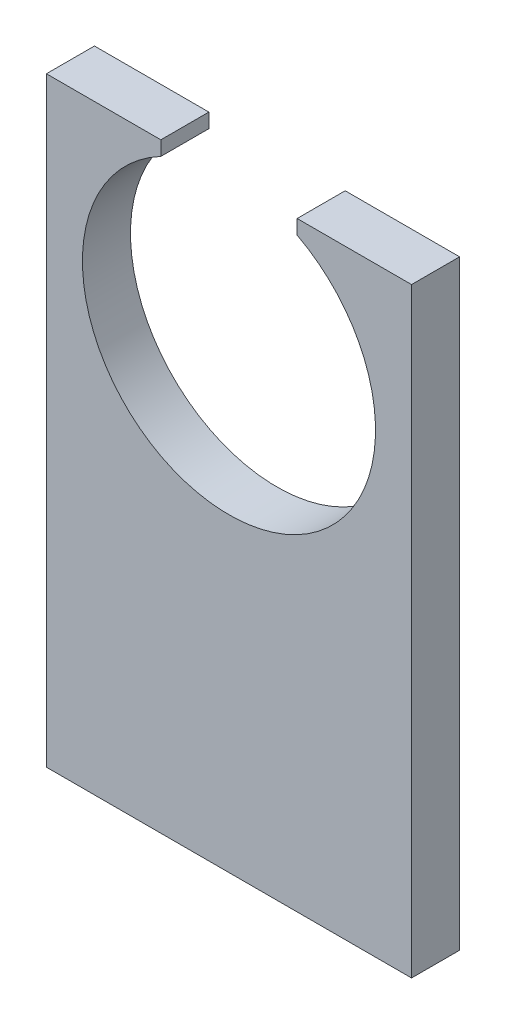
ISO-10303-21;
HEADER;
FILE_DESCRIPTION(('STEP AP214'),'2;1');
FILE_NAME('part.step','',(''),(''),'','','');
FILE_SCHEMA(('AUTOMOTIVE_DESIGN { 1 0 10303 214 1 1 1 1 }'));
ENDSEC;
DATA;
#1=APPLICATION_CONTEXT('core data for automotive mechanical design processes');
#2=APPLICATION_PROTOCOL_DEFINITION('international standard','automotive_design',2000,#1);
#3=PRODUCT_CONTEXT('',#1,'mechanical');
#4=PRODUCT('Part','Part','',(#3));
#5=PRODUCT_RELATED_PRODUCT_CATEGORY('part','',(#4));
#6=PRODUCT_DEFINITION_FORMATION('','',#4);
#7=PRODUCT_DEFINITION_CONTEXT('part definition',#1,'design');
#8=PRODUCT_DEFINITION('design','',#6,#7);
#9=PRODUCT_DEFINITION_SHAPE('','',#8);
#10=(LENGTH_UNIT() NAMED_UNIT(*) SI_UNIT(.MILLI.,.METRE.));
#11=(NAMED_UNIT(*) PLANE_ANGLE_UNIT() SI_UNIT($,.RADIAN.));
#12=(NAMED_UNIT(*) SI_UNIT($,.STERADIAN.) SOLID_ANGLE_UNIT());
#13=UNCERTAINTY_MEASURE_WITH_UNIT(LENGTH_MEASURE(1.E-05),#10,'distance_accuracy_value','');
#14=(GEOMETRIC_REPRESENTATION_CONTEXT(3) GLOBAL_UNCERTAINTY_ASSIGNED_CONTEXT((#13)) GLOBAL_UNIT_ASSIGNED_CONTEXT((#10,
#11,#12)) REPRESENTATION_CONTEXT('',''));
#15=CARTESIAN_POINT('',(0.,0.,0.));
#16=DIRECTION('',(0.,0.,1.));
#17=DIRECTION('',(1.,0.,0.));
#18=AXIS2_PLACEMENT_3D('',#15,#16,#17);
#19=CARTESIAN_POINT('',(0.,0.,48.));
#20=DIRECTION('',(0.,0.,1.));
#21=DIRECTION('',(1.,0.,0.));
#22=AXIS2_PLACEMENT_3D('',#19,#20,#21);
#23=PLANE('',#22);
#24=DIRECTION('',(0.,-1.,0.));
#25=VECTOR('',#24,1.);
#26=CARTESIAN_POINT('',(-14.1862609591111,0.,48.));
#27=LINE('',#26,#25);
#28=CARTESIAN_POINT('',(-14.1862609591111,117.5,48.));
#29=VERTEX_POINT('',#28);
#30=CARTESIAN_POINT('',(-14.1862609591111,114.5,48.));
#31=VERTEX_POINT('',#30);
#32=EDGE_CURVE('E102',#29,#31,#27,.T.);
#33=ORIENTED_EDGE('',*,*,#32,.F.);
#34=DIRECTION('',(1.,0.,0.));
#35=VECTOR('',#34,1.);
#36=CARTESIAN_POINT('',(-38.,117.5,48.));
#37=LINE('',#36,#35);
#38=CARTESIAN_POINT('',(-38.,117.5,48.));
#39=VERTEX_POINT('',#38);
#40=EDGE_CURVE('E158',#39,#29,#37,.T.);
#41=ORIENTED_EDGE('',*,*,#40,.F.);
#42=DIRECTION('',(0.,-1.,0.));
#43=VECTOR('',#42,1.);
#44=CARTESIAN_POINT('',(-38.,-7.5,48.));
#45=LINE('',#44,#43);
#46=CARTESIAN_POINT('',(-38.,-7.5,48.));
#47=VERTEX_POINT('',#46);
#48=EDGE_CURVE('E132',#39,#47,#45,.T.);
#49=ORIENTED_EDGE('',*,*,#48,.T.);
#50=DIRECTION('',(1.,0.,0.));
#51=VECTOR('',#50,1.);
#52=CARTESIAN_POINT('',(38.,-7.5,48.));
#53=LINE('',#52,#51);
#54=CARTESIAN_POINT('',(38.,-7.5,48.));
#55=VERTEX_POINT('',#54);
#56=EDGE_CURVE('E134',#47,#55,#53,.T.);
#57=ORIENTED_EDGE('',*,*,#56,.T.);
#58=DIRECTION('',(0.,1.,0.));
#59=VECTOR('',#58,1.);
#60=CARTESIAN_POINT('',(38.,-7.5,48.));
#61=LINE('',#60,#59);
#62=CARTESIAN_POINT('',(38.,117.5,48.));
#63=VERTEX_POINT('',#62);
#64=EDGE_CURVE('E137',#55,#63,#61,.T.);
#65=ORIENTED_EDGE('',*,*,#64,.T.);
#66=CARTESIAN_POINT('',(14.1862609591111,117.5,48.));
#67=VERTEX_POINT('',#66);
#68=EDGE_CURVE('E107',#67,#63,#37,.T.);
#69=ORIENTED_EDGE('',*,*,#68,.F.);
#70=DIRECTION('',(0.,-1.,0.));
#71=VECTOR('',#70,1.);
#72=CARTESIAN_POINT('',(14.1862609591111,0.,48.));
#73=LINE('',#72,#71);
#74=CARTESIAN_POINT('',(14.1862609591111,114.5,48.));
#75=VERTEX_POINT('',#74);
#76=EDGE_CURVE('E51',#67,#75,#73,.T.);
#77=ORIENTED_EDGE('',*,*,#76,.T.);
#78=CARTESIAN_POINT('',(0.,87.5,48.));
#79=DIRECTION('',(0.,0.,1.));
#80=DIRECTION('',(1.,0.,0.));
#81=AXIS2_PLACEMENT_3D('',#78,#79,#80);
#82=CIRCLE('',#81,30.5);
#83=EDGE_CURVE('E122',#31,#75,#82,.T.);
#84=ORIENTED_EDGE('',*,*,#83,.F.);
#85=EDGE_LOOP('',(#33,#41,#49,#57,#65,#69,#77,#84));
#86=FACE_BOUND('',#85,.T.);
#87=ADVANCED_FACE('F36',(#86),#23,.T.);
#88=CARTESIAN_POINT('',(0.,0.,38.));
#89=DIRECTION('',(0.,0.,1.));
#90=DIRECTION('',(1.,0.,0.));
#91=AXIS2_PLACEMENT_3D('',#88,#89,#90);
#92=PLANE('',#91);
#93=DIRECTION('',(1.,0.,0.));
#94=VECTOR('',#93,1.);
#95=CARTESIAN_POINT('',(-38.,117.5,38.));
#96=LINE('',#95,#94);
#97=CARTESIAN_POINT('',(-38.,117.5,38.));
#98=VERTEX_POINT('',#97);
#99=CARTESIAN_POINT('',(-14.1862609591111,117.5,38.));
#100=VERTEX_POINT('',#99);
#101=EDGE_CURVE('E117',#98,#100,#96,.T.);
#102=ORIENTED_EDGE('',*,*,#101,.T.);
#103=DIRECTION('',(0.,-1.,0.));
#104=VECTOR('',#103,1.);
#105=CARTESIAN_POINT('',(-14.1862609591111,0.,38.));
#106=LINE('',#105,#104);
#107=CARTESIAN_POINT('',(-14.1862609591111,114.5,38.));
#108=VERTEX_POINT('',#107);
#109=EDGE_CURVE('E59',#100,#108,#106,.T.);
#110=ORIENTED_EDGE('',*,*,#109,.T.);
#111=CARTESIAN_POINT('',(0.,87.5,38.));
#112=DIRECTION('',(0.,0.,1.));
#113=DIRECTION('',(1.,0.,0.));
#114=AXIS2_PLACEMENT_3D('',#111,#112,#113);
#115=CIRCLE('',#114,30.5);
#116=CARTESIAN_POINT('',(14.1862609591111,114.5,38.));
#117=VERTEX_POINT('',#116);
#118=EDGE_CURVE('E115',#108,#117,#115,.T.);
#119=ORIENTED_EDGE('',*,*,#118,.T.);
#120=DIRECTION('',(0.,-1.,0.));
#121=VECTOR('',#120,1.);
#122=CARTESIAN_POINT('',(14.1862609591111,0.,38.));
#123=LINE('',#122,#121);
#124=CARTESIAN_POINT('',(14.1862609591111,117.5,38.));
#125=VERTEX_POINT('',#124);
#126=EDGE_CURVE('E156',#125,#117,#123,.T.);
#127=ORIENTED_EDGE('',*,*,#126,.F.);
#128=CARTESIAN_POINT('',(38.,117.5,38.));
#129=VERTEX_POINT('',#128);
#130=EDGE_CURVE('E154',#125,#129,#96,.T.);
#131=ORIENTED_EDGE('',*,*,#130,.T.);
#132=DIRECTION('',(0.,1.,0.));
#133=VECTOR('',#132,1.);
#134=CARTESIAN_POINT('',(38.,-7.5,38.));
#135=LINE('',#134,#133);
#136=CARTESIAN_POINT('',(38.,-7.5,38.));
#137=VERTEX_POINT('',#136);
#138=EDGE_CURVE('E135',#137,#129,#135,.T.);
#139=ORIENTED_EDGE('',*,*,#138,.F.);
#140=DIRECTION('',(1.,0.,0.));
#141=VECTOR('',#140,1.);
#142=CARTESIAN_POINT('',(38.,-7.5,38.));
#143=LINE('',#142,#141);
#144=CARTESIAN_POINT('',(-38.,-7.5,38.));
#145=VERTEX_POINT('',#144);
#146=EDGE_CURVE('E141',#145,#137,#143,.T.);
#147=ORIENTED_EDGE('',*,*,#146,.F.);
#148=DIRECTION('',(0.,-1.,0.));
#149=VECTOR('',#148,1.);
#150=CARTESIAN_POINT('',(-38.,-7.5,38.));
#151=LINE('',#150,#149);
#152=EDGE_CURVE('E125',#98,#145,#151,.T.);
#153=ORIENTED_EDGE('',*,*,#152,.F.);
#154=EDGE_LOOP('',(#102,#110,#119,#127,#131,#139,#147,#153));
#155=FACE_BOUND('',#154,.T.);
#156=ADVANCED_FACE('F113',(#155),#92,.F.);
#157=CARTESIAN_POINT('',(0.,87.5,48.));
#158=DIRECTION('',(0.,0.,-1.));
#159=DIRECTION('',(-1.,0.,0.));
#160=AXIS2_PLACEMENT_3D('',#157,#158,#159);
#161=CYLINDRICAL_SURFACE('',#160,30.5);
#162=DIRECTION('',(0.,0.,1.));
#163=VECTOR('',#162,1.);
#164=CARTESIAN_POINT('',(-14.1862609591111,114.5,38.));
#165=LINE('',#164,#163);
#166=EDGE_CURVE('E99',#108,#31,#165,.T.);
#167=ORIENTED_EDGE('',*,*,#166,.T.);
#168=ORIENTED_EDGE('',*,*,#83,.T.);
#169=DIRECTION('',(0.,0.,1.));
#170=VECTOR('',#169,1.);
#171=CARTESIAN_POINT('',(14.1862609591111,114.5,38.));
#172=LINE('',#171,#170);
#173=EDGE_CURVE('E121',#117,#75,#172,.T.);
#174=ORIENTED_EDGE('',*,*,#173,.F.);
#175=ORIENTED_EDGE('',*,*,#118,.F.);
#176=EDGE_LOOP('',(#167,#168,#174,#175));
#177=FACE_BOUND('',#176,.T.);
#178=ADVANCED_FACE('F120',(#177),#161,.F.);
#179=CARTESIAN_POINT('',(-38.,117.5,38.));
#180=DIRECTION('',(0.,-1.,0.));
#181=DIRECTION('',(0.,0.,-1.));
#182=AXIS2_PLACEMENT_3D('',#179,#180,#181);
#183=PLANE('',#182);
#184=DIRECTION('',(0.,0.,1.));
#185=VECTOR('',#184,1.);
#186=CARTESIAN_POINT('',(14.1862609591111,117.5,38.));
#187=LINE('',#186,#185);
#188=EDGE_CURVE('E173',#125,#67,#187,.T.);
#189=ORIENTED_EDGE('',*,*,#188,.T.);
#190=ORIENTED_EDGE('',*,*,#68,.T.);
#191=DIRECTION('',(0.,0.,1.));
#192=VECTOR('',#191,1.);
#193=CARTESIAN_POINT('',(38.,117.5,38.));
#194=LINE('',#193,#192);
#195=EDGE_CURVE('E123',#129,#63,#194,.T.);
#196=ORIENTED_EDGE('',*,*,#195,.F.);
#197=ORIENTED_EDGE('',*,*,#130,.F.);
#198=EDGE_LOOP('',(#189,#190,#196,#197));
#199=FACE_BOUND('',#198,.T.);
#200=ADVANCED_FACE('F160',(#199),#183,.F.);
#201=CARTESIAN_POINT('',(-38.,-7.5,48.));
#202=DIRECTION('',(1.,0.,0.));
#203=DIRECTION('',(0.,0.,-1.));
#204=AXIS2_PLACEMENT_3D('',#201,#202,#203);
#205=PLANE('',#204);
#206=ORIENTED_EDGE('',*,*,#48,.F.);
#207=DIRECTION('',(0.,0.,1.));
#208=VECTOR('',#207,1.);
#209=CARTESIAN_POINT('',(-38.,117.5,38.));
#210=LINE('',#209,#208);
#211=EDGE_CURVE('E128',#98,#39,#210,.T.);
#212=ORIENTED_EDGE('',*,*,#211,.F.);
#213=ORIENTED_EDGE('',*,*,#152,.T.);
#214=DIRECTION('',(0.,0.,-1.));
#215=VECTOR('',#214,1.);
#216=CARTESIAN_POINT('',(-38.,-7.5,48.));
#217=LINE('',#216,#215);
#218=EDGE_CURVE('E11',#47,#145,#217,.T.);
#219=ORIENTED_EDGE('',*,*,#218,.F.);
#220=EDGE_LOOP('',(#206,#212,#213,#219));
#221=FACE_BOUND('',#220,.T.);
#222=ADVANCED_FACE('F38',(#221),#205,.F.);
#223=CARTESIAN_POINT('',(38.,-7.5,48.));
#224=DIRECTION('',(0.,1.,0.));
#225=DIRECTION('',(0.,0.,1.));
#226=AXIS2_PLACEMENT_3D('',#223,#224,#225);
#227=PLANE('',#226);
#228=ORIENTED_EDGE('',*,*,#146,.T.);
#229=DIRECTION('',(0.,0.,-1.));
#230=VECTOR('',#229,1.);
#231=CARTESIAN_POINT('',(38.,-7.5,48.));
#232=LINE('',#231,#230);
#233=EDGE_CURVE('E44',#55,#137,#232,.T.);
#234=ORIENTED_EDGE('',*,*,#233,.F.);
#235=ORIENTED_EDGE('',*,*,#56,.F.);
#236=ORIENTED_EDGE('',*,*,#218,.T.);
#237=EDGE_LOOP('',(#228,#234,#235,#236));
#238=FACE_BOUND('',#237,.T.);
#239=ADVANCED_FACE('F166',(#238),#227,.F.);
#240=CARTESIAN_POINT('',(38.,-7.5,48.));
#241=DIRECTION('',(-1.,0.,0.));
#242=DIRECTION('',(0.,0.,1.));
#243=AXIS2_PLACEMENT_3D('',#240,#241,#242);
#244=PLANE('',#243);
#245=ORIENTED_EDGE('',*,*,#138,.T.);
#246=ORIENTED_EDGE('',*,*,#195,.T.);
#247=ORIENTED_EDGE('',*,*,#64,.F.);
#248=ORIENTED_EDGE('',*,*,#233,.T.);
#249=EDGE_LOOP('',(#245,#246,#247,#248));
#250=FACE_BOUND('',#249,.T.);
#251=ADVANCED_FACE('F149',(#250),#244,.F.);
#252=ORIENTED_EDGE('',*,*,#40,.T.);
#253=DIRECTION('',(0.,0.,1.));
#254=VECTOR('',#253,1.);
#255=CARTESIAN_POINT('',(-14.1862609591111,117.5,38.));
#256=LINE('',#255,#254);
#257=EDGE_CURVE('E108',#100,#29,#256,.T.);
#258=ORIENTED_EDGE('',*,*,#257,.F.);
#259=ORIENTED_EDGE('',*,*,#101,.F.);
#260=ORIENTED_EDGE('',*,*,#211,.T.);
#261=EDGE_LOOP('',(#252,#258,#259,#260));
#262=FACE_BOUND('',#261,.T.);
#263=ADVANCED_FACE('F179',(#262),#183,.F.);
#264=CARTESIAN_POINT('',(-14.1862609591111,0.,38.));
#265=DIRECTION('',(-1.,0.,0.));
#266=DIRECTION('',(0.,0.,1.));
#267=AXIS2_PLACEMENT_3D('',#264,#265,#266);
#268=PLANE('',#267);
#269=ORIENTED_EDGE('',*,*,#32,.T.);
#270=ORIENTED_EDGE('',*,*,#166,.F.);
#271=ORIENTED_EDGE('',*,*,#109,.F.);
#272=ORIENTED_EDGE('',*,*,#257,.T.);
#273=EDGE_LOOP('',(#269,#270,#271,#272));
#274=FACE_BOUND('',#273,.T.);
#275=ADVANCED_FACE('F100',(#274),#268,.F.);
#276=CARTESIAN_POINT('',(14.1862609591111,0.,38.));
#277=DIRECTION('',(-1.,0.,0.));
#278=DIRECTION('',(0.,0.,1.));
#279=AXIS2_PLACEMENT_3D('',#276,#277,#278);
#280=PLANE('',#279);
#281=ORIENTED_EDGE('',*,*,#76,.F.);
#282=ORIENTED_EDGE('',*,*,#188,.F.);
#283=ORIENTED_EDGE('',*,*,#126,.T.);
#284=ORIENTED_EDGE('',*,*,#173,.T.);
#285=EDGE_LOOP('',(#281,#282,#283,#284));
#286=FACE_BOUND('',#285,.T.);
#287=ADVANCED_FACE('F186',(#286),#280,.T.);
#288=CLOSED_SHELL('',(#87,#156,#178,#200,#222,#239,#251,#263,#275,#287));
#289=MANIFOLD_SOLID_BREP('B2',#288);
#290=ADVANCED_BREP_SHAPE_REPRESENTATION('',(#18,#289),#14);
#291=SHAPE_DEFINITION_REPRESENTATION(#9,#290);
ENDSEC;
END-ISO-10303-21;
